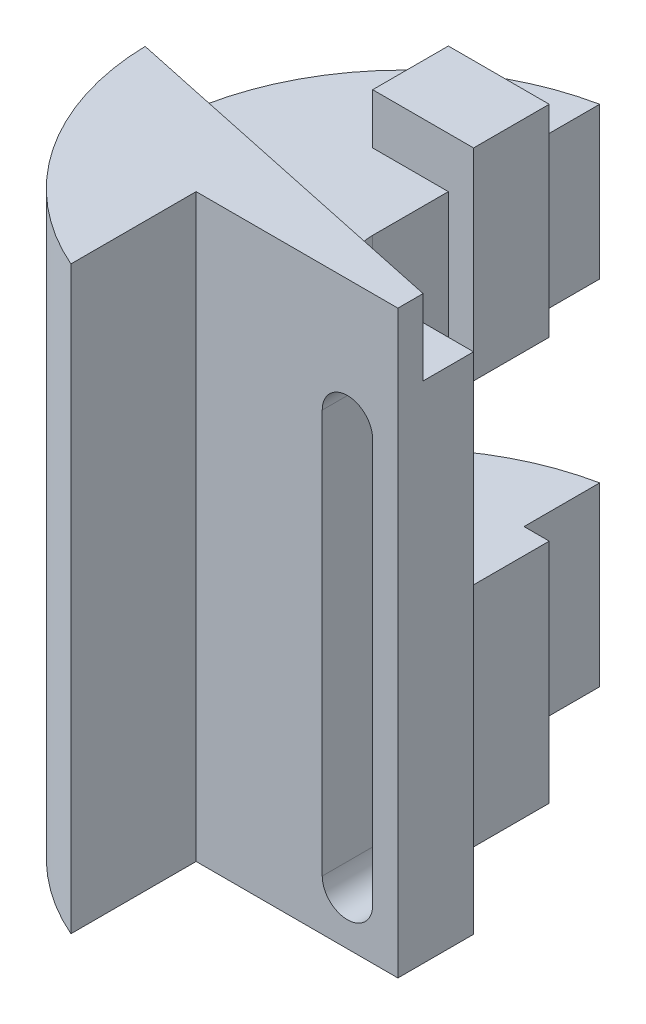
ISO-10303-21;
HEADER;
FILE_DESCRIPTION(('STEP AP214'),'2;1');
FILE_NAME('part.step','',(''),(''),'','','');
FILE_SCHEMA(('AUTOMOTIVE_DESIGN { 1 0 10303 214 1 1 1 1 }'));
ENDSEC;
DATA;
#1=APPLICATION_CONTEXT('core data for automotive mechanical design processes');
#2=APPLICATION_PROTOCOL_DEFINITION('international standard','automotive_design',2000,#1);
#3=PRODUCT_CONTEXT('',#1,'mechanical');
#4=PRODUCT('Part','Part','',(#3));
#5=PRODUCT_RELATED_PRODUCT_CATEGORY('part','',(#4));
#6=PRODUCT_DEFINITION_FORMATION('','',#4);
#7=PRODUCT_DEFINITION_CONTEXT('part definition',#1,'design');
#8=PRODUCT_DEFINITION('design','',#6,#7);
#9=PRODUCT_DEFINITION_SHAPE('','',#8);
#10=(LENGTH_UNIT() NAMED_UNIT(*) SI_UNIT(.MILLI.,.METRE.));
#11=(NAMED_UNIT(*) PLANE_ANGLE_UNIT() SI_UNIT($,.RADIAN.));
#12=(NAMED_UNIT(*) SI_UNIT($,.STERADIAN.) SOLID_ANGLE_UNIT());
#13=UNCERTAINTY_MEASURE_WITH_UNIT(LENGTH_MEASURE(1.E-05),#10,'distance_accuracy_value','');
#14=(GEOMETRIC_REPRESENTATION_CONTEXT(3) GLOBAL_UNCERTAINTY_ASSIGNED_CONTEXT((#13)) GLOBAL_UNIT_ASSIGNED_CONTEXT((#10,
#11,#12)) REPRESENTATION_CONTEXT('',''));
#15=CARTESIAN_POINT('',(0.,0.,0.));
#16=DIRECTION('',(0.,0.,1.));
#17=DIRECTION('',(1.,0.,0.));
#18=AXIS2_PLACEMENT_3D('',#15,#16,#17);
#19=CARTESIAN_POINT('',(-20.,0.,-10.));
#20=DIRECTION('',(0.,-1.,0.));
#21=DIRECTION('',(0.,0.,-1.));
#22=AXIS2_PLACEMENT_3D('',#19,#20,#21);
#23=PLANE('',#22);
#24=DIRECTION('',(0.,0.,-1.));
#25=VECTOR('',#24,1.);
#26=CARTESIAN_POINT('',(-45.0025450609642,0.,-25.));
#27=LINE('',#26,#25);
#28=CARTESIAN_POINT('',(-45.0025450609642,0.,-25.));
#29=VERTEX_POINT('',#28);
#30=CARTESIAN_POINT('',(-45.0025450609642,0.,-40.));
#31=VERTEX_POINT('',#30);
#32=EDGE_CURVE('E255',#29,#31,#27,.T.);
#33=ORIENTED_EDGE('',*,*,#32,.F.);
#34=DIRECTION('',(-1.,0.,0.));
#35=VECTOR('',#34,1.);
#36=CARTESIAN_POINT('',(-30.,0.,-25.));
#37=LINE('',#36,#35);
#38=CARTESIAN_POINT('',(-30.,0.,-25.));
#39=VERTEX_POINT('',#38);
#40=EDGE_CURVE('E244',#39,#29,#37,.T.);
#41=ORIENTED_EDGE('',*,*,#40,.F.);
#42=DIRECTION('',(0.,0.,-1.));
#43=VECTOR('',#42,1.);
#44=CARTESIAN_POINT('',(-30.,0.,-10.0000000000001));
#45=LINE('',#44,#43);
#46=CARTESIAN_POINT('',(-30.,0.,-10.0000000000001));
#47=VERTEX_POINT('',#46);
#48=EDGE_CURVE('E397',#47,#39,#45,.T.);
#49=ORIENTED_EDGE('',*,*,#48,.F.);
#50=CARTESIAN_POINT('',(-20.,0.,-10.));
#51=DIRECTION('',(0.,-1.,0.));
#52=DIRECTION('',(0.,0.,-1.));
#53=AXIS2_PLACEMENT_3D('',#50,#51,#52);
#54=CIRCLE('',#53,10.);
#55=CARTESIAN_POINT('',(-19.9999999999999,0.,0.));
#56=VERTEX_POINT('',#55);
#57=EDGE_CURVE('E393',#56,#47,#54,.T.);
#58=ORIENTED_EDGE('',*,*,#57,.F.);
#59=DIRECTION('',(-1.,0.,0.));
#60=VECTOR('',#59,1.);
#61=CARTESIAN_POINT('',(0.,0.,0.));
#62=LINE('',#61,#60);
#63=CARTESIAN_POINT('',(0.,0.,0.));
#64=VERTEX_POINT('',#63);
#65=EDGE_CURVE('E377',#64,#56,#62,.T.);
#66=ORIENTED_EDGE('',*,*,#65,.F.);
#67=DIRECTION('',(0.,0.,-1.));
#68=VECTOR('',#67,1.);
#69=CARTESIAN_POINT('',(0.,0.,0.));
#70=LINE('',#69,#68);
#71=CARTESIAN_POINT('',(0.,0.,15.));
#72=VERTEX_POINT('',#71);
#73=EDGE_CURVE('E383',#72,#64,#70,.T.);
#74=ORIENTED_EDGE('',*,*,#73,.F.);
#75=DIRECTION('',(1.,0.,0.));
#76=VECTOR('',#75,1.);
#77=CARTESIAN_POINT('',(0.,0.,15.));
#78=LINE('',#77,#76);
#79=CARTESIAN_POINT('',(-40.,0.,15.));
#80=VERTEX_POINT('',#79);
#81=EDGE_CURVE('E404',#80,#72,#78,.T.);
#82=ORIENTED_EDGE('',*,*,#81,.F.);
#83=DIRECTION('',(0.,0.,-1.));
#84=VECTOR('',#83,1.);
#85=CARTESIAN_POINT('',(-40.,0.,15.));
#86=LINE('',#85,#84);
#87=CARTESIAN_POINT('',(-40.,0.,39.815551805222));
#88=VERTEX_POINT('',#87);
#89=EDGE_CURVE('E402',#88,#80,#86,.T.);
#90=ORIENTED_EDGE('',*,*,#89,.F.);
#91=CARTESIAN_POINT('',(-20.,0.,-6.01020514433643));
#92=DIRECTION('',(0.,1.,0.));
#93=DIRECTION('',(0.,0.,1.));
#94=AXIS2_PLACEMENT_3D('',#91,#92,#93);
#95=CIRCLE('',#94,50.);
#96=CARTESIAN_POINT('',(-30.,0.,-55.));
#97=VERTEX_POINT('',#96);
#98=EDGE_CURVE('E400',#97,#88,#95,.T.);
#99=ORIENTED_EDGE('',*,*,#98,.F.);
#100=CARTESIAN_POINT('',(-30.,0.,-40.));
#101=VERTEX_POINT('',#100);
#102=EDGE_CURVE('E396',#101,#97,#45,.T.);
#103=ORIENTED_EDGE('',*,*,#102,.F.);
#104=DIRECTION('',(1.,0.,0.));
#105=VECTOR('',#104,1.);
#106=CARTESIAN_POINT('',(-30.,0.,-40.));
#107=LINE('',#106,#105);
#108=EDGE_CURVE('E252',#31,#101,#107,.T.);
#109=ORIENTED_EDGE('',*,*,#108,.F.);
#110=EDGE_LOOP('',(#33,#41,#49,#58,#66,#74,#82,#90,#99,#103,#109));
#111=FACE_BOUND('',#110,.T.);
#112=ADVANCED_FACE('F41',(#111),#23,.T.);
#113=CARTESIAN_POINT('',(-19.9999999999999,100.,-10.0000000000001));
#114=DIRECTION('',(0.,1.,0.));
#115=DIRECTION('',(0.,0.,1.));
#116=AXIS2_PLACEMENT_3D('',#113,#114,#115);
#117=PLANE('',#116);
#118=DIRECTION('',(0.,0.,1.));
#119=VECTOR('',#118,1.);
#120=CARTESIAN_POINT('',(-45.,100.,-40.));
#121=LINE('',#120,#119);
#122=CARTESIAN_POINT('',(-45.,100.,-40.));
#123=VERTEX_POINT('',#122);
#124=CARTESIAN_POINT('',(-45.,100.,-25.));
#125=VERTEX_POINT('',#124);
#126=EDGE_CURVE('E265',#123,#125,#121,.T.);
#127=ORIENTED_EDGE('',*,*,#126,.F.);
#128=DIRECTION('',(-1.,0.,0.));
#129=VECTOR('',#128,1.);
#130=CARTESIAN_POINT('',(-30.,100.,-40.));
#131=LINE('',#130,#129);
#132=CARTESIAN_POINT('',(-30.,100.,-40.));
#133=VERTEX_POINT('',#132);
#134=EDGE_CURVE('E247',#133,#123,#131,.T.);
#135=ORIENTED_EDGE('',*,*,#134,.F.);
#136=DIRECTION('',(0.,0.,-1.));
#137=VECTOR('',#136,1.);
#138=CARTESIAN_POINT('',(-30.,100.,-55.));
#139=LINE('',#138,#137);
#140=CARTESIAN_POINT('',(-30.,100.,-55.));
#141=VERTEX_POINT('',#140);
#142=EDGE_CURVE('E279',#133,#141,#139,.T.);
#143=ORIENTED_EDGE('',*,*,#142,.T.);
#144=CARTESIAN_POINT('',(-20.,100.,-6.01020514433643));
#145=DIRECTION('',(0.,1.,0.));
#146=DIRECTION('',(0.,0.,1.));
#147=AXIS2_PLACEMENT_3D('',#144,#145,#146);
#148=CIRCLE('',#147,50.);
#149=CARTESIAN_POINT('',(-69.987139251767,100.,-4.87622568047638));
#150=VERTEX_POINT('',#149);
#151=EDGE_CURVE('E283',#141,#150,#148,.T.);
#152=ORIENTED_EDGE('',*,*,#151,.T.);
#153=DIRECTION('',(0.978147600733806,0.,0.207911690817756));
#154=VECTOR('',#153,1.);
#155=CARTESIAN_POINT('',(0.,100.,10.));
#156=LINE('',#155,#154);
#157=CARTESIAN_POINT('',(0.,100.,10.));
#158=VERTEX_POINT('',#157);
#159=EDGE_CURVE('E285',#150,#158,#156,.T.);
#160=ORIENTED_EDGE('',*,*,#159,.T.);
#161=DIRECTION('',(0.,0.,-1.));
#162=VECTOR('',#161,1.);
#163=CARTESIAN_POINT('',(0.,100.,10.));
#164=LINE('',#163,#162);
#165=CARTESIAN_POINT('',(0.,100.,0.));
#166=VERTEX_POINT('',#165);
#167=EDGE_CURVE('E273',#158,#166,#164,.T.);
#168=ORIENTED_EDGE('',*,*,#167,.T.);
#169=DIRECTION('',(-1.,0.,0.));
#170=VECTOR('',#169,1.);
#171=CARTESIAN_POINT('',(0.,100.,0.));
#172=LINE('',#171,#170);
#173=CARTESIAN_POINT('',(-19.9999999999999,100.,0.));
#174=VERTEX_POINT('',#173);
#175=EDGE_CURVE('E275',#166,#174,#172,.T.);
#176=ORIENTED_EDGE('',*,*,#175,.T.);
#177=CARTESIAN_POINT('',(-19.9999999999999,100.,-10.0000000000001));
#178=DIRECTION('',(0.,-1.,0.));
#179=DIRECTION('',(0.,0.,1.));
#180=AXIS2_PLACEMENT_3D('',#177,#178,#179);
#181=CIRCLE('',#180,10.0000000000001);
#182=CARTESIAN_POINT('',(-30.,100.,-10.0000000000001));
#183=VERTEX_POINT('',#182);
#184=EDGE_CURVE('E277',#174,#183,#181,.T.);
#185=ORIENTED_EDGE('',*,*,#184,.T.);
#186=CARTESIAN_POINT('',(-30.,100.,-25.));
#187=VERTEX_POINT('',#186);
#188=EDGE_CURVE('E280',#183,#187,#139,.T.);
#189=ORIENTED_EDGE('',*,*,#188,.T.);
#190=DIRECTION('',(1.,0.,0.));
#191=VECTOR('',#190,1.);
#192=CARTESIAN_POINT('',(-30.,100.,-25.));
#193=LINE('',#192,#191);
#194=EDGE_CURVE('E263',#125,#187,#193,.T.);
#195=ORIENTED_EDGE('',*,*,#194,.F.);
#196=EDGE_LOOP('',(#127,#135,#143,#152,#160,#168,#176,#185,#189,#195));
#197=FACE_BOUND('',#196,.T.);
#198=ADVANCED_FACE('F475',(#197),#117,.T.);
#199=CARTESIAN_POINT('',(-30.,115.,-10.0000000000001));
#200=DIRECTION('',(-1.,0.,0.));
#201=DIRECTION('',(0.,0.,1.));
#202=AXIS2_PLACEMENT_3D('',#199,#200,#201);
#203=PLANE('',#202);
#204=ORIENTED_EDGE('',*,*,#188,.F.);
#205=DIRECTION('',(0.,-1.,0.));
#206=VECTOR('',#205,1.);
#207=CARTESIAN_POINT('',(-30.,115.,-10.0000000000001));
#208=LINE('',#207,#206);
#209=EDGE_CURVE('E421',#183,#47,#208,.T.);
#210=ORIENTED_EDGE('',*,*,#209,.T.);
#211=ORIENTED_EDGE('',*,*,#48,.T.);
#212=DIRECTION('',(0.,-1.,0.));
#213=VECTOR('',#212,1.);
#214=CARTESIAN_POINT('',(-30.,35.,-25.));
#215=LINE('',#214,#213);
#216=CARTESIAN_POINT('',(-30.,35.,-25.));
#217=VERTEX_POINT('',#216);
#218=EDGE_CURVE('E299',#217,#39,#215,.T.);
#219=ORIENTED_EDGE('',*,*,#218,.F.);
#220=DIRECTION('',(0.,0.,-1.));
#221=VECTOR('',#220,1.);
#222=CARTESIAN_POINT('',(-30.,35.,-55.));
#223=LINE('',#222,#221);
#224=CARTESIAN_POINT('',(-30.,35.,-15.));
#225=VERTEX_POINT('',#224);
#226=EDGE_CURVE('E371',#225,#217,#223,.T.);
#227=ORIENTED_EDGE('',*,*,#226,.F.);
#228=DIRECTION('',(0.,-1.,0.));
#229=VECTOR('',#228,1.);
#230=CARTESIAN_POINT('',(-30.,70.,-15.));
#231=LINE('',#230,#229);
#232=CARTESIAN_POINT('',(-30.,70.,-15.));
#233=VERTEX_POINT('',#232);
#234=EDGE_CURVE('E367',#233,#225,#231,.T.);
#235=ORIENTED_EDGE('',*,*,#234,.F.);
#236=DIRECTION('',(0.,0.,1.));
#237=VECTOR('',#236,1.);
#238=CARTESIAN_POINT('',(-30.,70.,-55.));
#239=LINE('',#238,#237);
#240=CARTESIAN_POINT('',(-30.,70.,-25.));
#241=VERTEX_POINT('',#240);
#242=EDGE_CURVE('E363',#241,#233,#239,.T.);
#243=ORIENTED_EDGE('',*,*,#242,.F.);
#244=DIRECTION('',(0.,-1.,0.));
#245=VECTOR('',#244,1.);
#246=CARTESIAN_POINT('',(-30.,70.,-25.));
#247=LINE('',#246,#245);
#248=EDGE_CURVE('E321',#187,#241,#247,.T.);
#249=ORIENTED_EDGE('',*,*,#248,.F.);
#250=EDGE_LOOP('',(#204,#210,#211,#219,#227,#235,#243,#249));
#251=FACE_BOUND('',#250,.T.);
#252=ADVANCED_FACE('F491',(#251),#203,.F.);
#253=ORIENTED_EDGE('',*,*,#142,.F.);
#254=DIRECTION('',(0.,1.,0.));
#255=VECTOR('',#254,1.);
#256=CARTESIAN_POINT('',(-30.,70.,-40.));
#257=LINE('',#256,#255);
#258=CARTESIAN_POINT('',(-30.,70.,-40.));
#259=VERTEX_POINT('',#258);
#260=EDGE_CURVE('E306',#259,#133,#257,.T.);
#261=ORIENTED_EDGE('',*,*,#260,.F.);
#262=CARTESIAN_POINT('',(-30.,70.,-55.));
#263=VERTEX_POINT('',#262);
#264=EDGE_CURVE('E364',#263,#259,#239,.T.);
#265=ORIENTED_EDGE('',*,*,#264,.F.);
#266=DIRECTION('',(0.,-1.,0.));
#267=VECTOR('',#266,1.);
#268=CARTESIAN_POINT('',(-30.,115.,-55.));
#269=LINE('',#268,#267);
#270=EDGE_CURVE('E419',#141,#263,#269,.T.);
#271=ORIENTED_EDGE('',*,*,#270,.F.);
#272=EDGE_LOOP('',(#253,#261,#265,#271));
#273=FACE_BOUND('',#272,.T.);
#274=ADVANCED_FACE('F540',(#273),#203,.F.);
#275=CARTESIAN_POINT('',(0.,115.,0.));
#276=DIRECTION('',(0.,0.,1.));
#277=DIRECTION('',(1.,0.,0.));
#278=AXIS2_PLACEMENT_3D('',#275,#276,#277);
#279=PLANE('',#278);
#280=DIRECTION('',(0.,-1.,0.));
#281=VECTOR('',#280,1.);
#282=CARTESIAN_POINT('',(-4.99999999999998,90.,0.));
#283=LINE('',#282,#281);
#284=CARTESIAN_POINT('',(-4.99999999999998,90.,0.));
#285=VERTEX_POINT('',#284);
#286=CARTESIAN_POINT('',(-5.,9.99999999999999,0.));
#287=VERTEX_POINT('',#286);
#288=EDGE_CURVE('E342',#285,#287,#283,.T.);
#289=ORIENTED_EDGE('',*,*,#288,.F.);
#290=CARTESIAN_POINT('',(-9.99999999999997,90.,0.));
#291=DIRECTION('',(0.,0.,-1.));
#292=DIRECTION('',(1.,0.,0.));
#293=AXIS2_PLACEMENT_3D('',#290,#291,#292);
#294=CIRCLE('',#293,5.);
#295=CARTESIAN_POINT('',(-15.,90.,0.));
#296=VERTEX_POINT('',#295);
#297=EDGE_CURVE('E340',#296,#285,#294,.T.);
#298=ORIENTED_EDGE('',*,*,#297,.F.);
#299=DIRECTION('',(0.,1.,0.));
#300=VECTOR('',#299,1.);
#301=CARTESIAN_POINT('',(-15.,90.,0.));
#302=LINE('',#301,#300);
#303=CARTESIAN_POINT('',(-15.,9.99999999999999,0.));
#304=VERTEX_POINT('',#303);
#305=EDGE_CURVE('E348',#304,#296,#302,.T.);
#306=ORIENTED_EDGE('',*,*,#305,.F.);
#307=CARTESIAN_POINT('',(-10.,9.99999999999999,0.));
#308=DIRECTION('',(0.,0.,-1.));
#309=DIRECTION('',(-1.,0.,0.));
#310=AXIS2_PLACEMENT_3D('',#307,#308,#309);
#311=CIRCLE('',#310,5.);
#312=EDGE_CURVE('E345',#287,#304,#311,.T.);
#313=ORIENTED_EDGE('',*,*,#312,.F.);
#314=EDGE_LOOP('',(#289,#298,#306,#313));
#315=FACE_BOUND('',#314,.T.);
#316=ORIENTED_EDGE('',*,*,#175,.F.);
#317=DIRECTION('',(0.,-1.,0.));
#318=VECTOR('',#317,1.);
#319=CARTESIAN_POINT('',(0.,115.,0.));
#320=LINE('',#319,#318);
#321=EDGE_CURVE('E390',#166,#64,#320,.T.);
#322=ORIENTED_EDGE('',*,*,#321,.T.);
#323=ORIENTED_EDGE('',*,*,#65,.T.);
#324=DIRECTION('',(0.,-1.,0.));
#325=VECTOR('',#324,1.);
#326=CARTESIAN_POINT('',(-19.9999999999999,115.,0.));
#327=LINE('',#326,#325);
#328=EDGE_CURVE('E423',#174,#56,#327,.T.);
#329=ORIENTED_EDGE('',*,*,#328,.F.);
#330=EDGE_LOOP('',(#316,#322,#323,#329));
#331=FACE_BOUND('',#330,.T.);
#332=ADVANCED_FACE('F43',(#315,#331),#279,.F.);
#333=CARTESIAN_POINT('',(-20.,115.,-10.));
#334=DIRECTION('',(0.,-1.,0.));
#335=DIRECTION('',(0.,0.,-1.));
#336=AXIS2_PLACEMENT_3D('',#333,#334,#335);
#337=CYLINDRICAL_SURFACE('',#336,10.);
#338=ORIENTED_EDGE('',*,*,#184,.F.);
#339=ORIENTED_EDGE('',*,*,#328,.T.);
#340=ORIENTED_EDGE('',*,*,#57,.T.);
#341=ORIENTED_EDGE('',*,*,#209,.F.);
#342=EDGE_LOOP('',(#338,#339,#340,#341));
#343=FACE_BOUND('',#342,.T.);
#344=ADVANCED_FACE('F487',(#343),#337,.F.);
#345=DIRECTION('',(0.,1.,0.));
#346=VECTOR('',#345,1.);
#347=CARTESIAN_POINT('',(-30.,35.,-40.));
#348=LINE('',#347,#346);
#349=CARTESIAN_POINT('',(-30.,35.,-40.));
#350=VERTEX_POINT('',#349);
#351=EDGE_CURVE('E304',#101,#350,#348,.T.);
#352=ORIENTED_EDGE('',*,*,#351,.F.);
#353=ORIENTED_EDGE('',*,*,#102,.T.);
#354=CARTESIAN_POINT('',(-30.,35.,-55.));
#355=VERTEX_POINT('',#354);
#356=EDGE_CURVE('E418',#355,#97,#269,.T.);
#357=ORIENTED_EDGE('',*,*,#356,.F.);
#358=EDGE_CURVE('E370',#350,#355,#223,.T.);
#359=ORIENTED_EDGE('',*,*,#358,.F.);
#360=EDGE_LOOP('',(#352,#353,#357,#359));
#361=FACE_BOUND('',#360,.T.);
#362=ADVANCED_FACE('F445',(#361),#203,.F.);
#363=CARTESIAN_POINT('',(-20.,115.,-6.01020514433643));
#364=DIRECTION('',(0.,-1.,0.));
#365=DIRECTION('',(0.,0.,-1.));
#366=AXIS2_PLACEMENT_3D('',#363,#364,#365);
#367=CYLINDRICAL_SURFACE('',#366,50.);
#368=CARTESIAN_POINT('',(-20.,115.,-6.01020514433643));
#369=DIRECTION('',(0.,1.,0.));
#370=DIRECTION('',(0.,0.,1.));
#371=AXIS2_PLACEMENT_3D('',#368,#369,#370);
#372=CIRCLE('',#371,50.);
#373=CARTESIAN_POINT('',(-69.987139251767,115.,-4.87622568047638));
#374=VERTEX_POINT('',#373);
#375=CARTESIAN_POINT('',(-40.,115.,39.815551805222));
#376=VERTEX_POINT('',#375);
#377=EDGE_CURVE('E380',#374,#376,#372,.T.);
#378=ORIENTED_EDGE('',*,*,#377,.F.);
#379=DIRECTION('',(0.,1.,0.));
#380=VECTOR('',#379,1.);
#381=CARTESIAN_POINT('',(-69.987139251767,100.,-4.87622568047638));
#382=LINE('',#381,#380);
#383=EDGE_CURVE('E288',#150,#374,#382,.T.);
#384=ORIENTED_EDGE('',*,*,#383,.F.);
#385=ORIENTED_EDGE('',*,*,#151,.F.);
#386=ORIENTED_EDGE('',*,*,#270,.T.);
#387=CARTESIAN_POINT('',(-20.,70.,-6.01020514433643));
#388=DIRECTION('',(0.,1.,0.));
#389=DIRECTION('',(0.,0.,1.));
#390=AXIS2_PLACEMENT_3D('',#387,#388,#389);
#391=CIRCLE('',#390,50.);
#392=CARTESIAN_POINT('',(-69.1851968426791,70.,-15.));
#393=VERTEX_POINT('',#392);
#394=EDGE_CURVE('E425',#263,#393,#391,.T.);
#395=ORIENTED_EDGE('',*,*,#394,.T.);
#396=DIRECTION('',(0.,-1.,0.));
#397=VECTOR('',#396,1.);
#398=CARTESIAN_POINT('',(-69.1851968426791,115.,-15.));
#399=LINE('',#398,#397);
#400=CARTESIAN_POINT('',(-69.1851968426791,35.,-15.));
#401=VERTEX_POINT('',#400);
#402=EDGE_CURVE('E49',#393,#401,#399,.T.);
#403=ORIENTED_EDGE('',*,*,#402,.T.);
#404=CARTESIAN_POINT('',(-20.,35.,-6.01020514433643));
#405=DIRECTION('',(0.,-1.,0.));
#406=DIRECTION('',(0.,0.,-1.));
#407=AXIS2_PLACEMENT_3D('',#404,#405,#406);
#408=CIRCLE('',#407,50.);
#409=EDGE_CURVE('E11',#401,#355,#408,.T.);
#410=ORIENTED_EDGE('',*,*,#409,.T.);
#411=ORIENTED_EDGE('',*,*,#356,.T.);
#412=ORIENTED_EDGE('',*,*,#98,.T.);
#413=DIRECTION('',(0.,-1.,0.));
#414=VECTOR('',#413,1.);
#415=CARTESIAN_POINT('',(-40.,115.,39.815551805222));
#416=LINE('',#415,#414);
#417=EDGE_CURVE('E415',#376,#88,#416,.T.);
#418=ORIENTED_EDGE('',*,*,#417,.F.);
#419=EDGE_LOOP('',(#378,#384,#385,#386,#395,#403,#410,#411,#412,#418));
#420=FACE_BOUND('',#419,.T.);
#421=ADVANCED_FACE('F431',(#420),#367,.T.);
#422=CARTESIAN_POINT('',(-40.,115.,15.));
#423=DIRECTION('',(-1.,0.,0.));
#424=DIRECTION('',(0.,0.,1.));
#425=AXIS2_PLACEMENT_3D('',#422,#423,#424);
#426=PLANE('',#425);
#427=ORIENTED_EDGE('',*,*,#89,.T.);
#428=DIRECTION('',(0.,-1.,0.));
#429=VECTOR('',#428,1.);
#430=CARTESIAN_POINT('',(-40.,115.,15.));
#431=LINE('',#430,#429);
#432=CARTESIAN_POINT('',(-40.,115.,15.));
#433=VERTEX_POINT('',#432);
#434=EDGE_CURVE('E412',#433,#80,#431,.T.);
#435=ORIENTED_EDGE('',*,*,#434,.F.);
#436=DIRECTION('',(0.,0.,-1.));
#437=VECTOR('',#436,1.);
#438=CARTESIAN_POINT('',(-40.,115.,15.));
#439=LINE('',#438,#437);
#440=EDGE_CURVE('E382',#376,#433,#439,.T.);
#441=ORIENTED_EDGE('',*,*,#440,.F.);
#442=ORIENTED_EDGE('',*,*,#417,.T.);
#443=EDGE_LOOP('',(#427,#435,#441,#442));
#444=FACE_BOUND('',#443,.T.);
#445=ADVANCED_FACE('F456',(#444),#426,.F.);
#446=CARTESIAN_POINT('',(0.,115.,15.));
#447=DIRECTION('',(0.,0.,-1.));
#448=DIRECTION('',(-1.,0.,0.));
#449=AXIS2_PLACEMENT_3D('',#446,#447,#448);
#450=PLANE('',#449);
#451=DIRECTION('',(0.,-1.,0.));
#452=VECTOR('',#451,1.);
#453=CARTESIAN_POINT('',(-15.,90.,15.));
#454=LINE('',#453,#452);
#455=CARTESIAN_POINT('',(-15.,90.,15.));
#456=VERTEX_POINT('',#455);
#457=CARTESIAN_POINT('',(-15.,9.99999999999999,15.));
#458=VERTEX_POINT('',#457);
#459=EDGE_CURVE('E334',#456,#458,#454,.T.);
#460=ORIENTED_EDGE('',*,*,#459,.F.);
#461=CARTESIAN_POINT('',(-9.99999999999997,90.,15.));
#462=DIRECTION('',(0.,0.,-1.));
#463=DIRECTION('',(-1.,0.,0.));
#464=AXIS2_PLACEMENT_3D('',#461,#462,#463);
#465=CIRCLE('',#464,5.);
#466=CARTESIAN_POINT('',(-4.99999999999997,90.,15.));
#467=VERTEX_POINT('',#466);
#468=EDGE_CURVE('E337',#467,#456,#465,.F.);
#469=ORIENTED_EDGE('',*,*,#468,.F.);
#470=DIRECTION('',(0.,1.,0.));
#471=VECTOR('',#470,1.);
#472=CARTESIAN_POINT('',(-4.99999999999997,90.,15.));
#473=LINE('',#472,#471);
#474=CARTESIAN_POINT('',(-5.,9.99999999999999,15.));
#475=VERTEX_POINT('',#474);
#476=EDGE_CURVE('E354',#475,#467,#473,.T.);
#477=ORIENTED_EDGE('',*,*,#476,.F.);
#478=CARTESIAN_POINT('',(-10.,9.99999999999999,15.));
#479=DIRECTION('',(0.,0.,-1.));
#480=DIRECTION('',(-1.,0.,0.));
#481=AXIS2_PLACEMENT_3D('',#478,#479,#480);
#482=CIRCLE('',#481,5.);
#483=EDGE_CURVE('E311',#458,#475,#482,.F.);
#484=ORIENTED_EDGE('',*,*,#483,.F.);
#485=EDGE_LOOP('',(#460,#469,#477,#484));
#486=FACE_BOUND('',#485,.T.);
#487=ORIENTED_EDGE('',*,*,#81,.T.);
#488=DIRECTION('',(0.,-1.,0.));
#489=VECTOR('',#488,1.);
#490=CARTESIAN_POINT('',(0.,115.,15.));
#491=LINE('',#490,#489);
#492=CARTESIAN_POINT('',(0.,115.,15.));
#493=VERTEX_POINT('',#492);
#494=EDGE_CURVE('E409',#493,#72,#491,.T.);
#495=ORIENTED_EDGE('',*,*,#494,.F.);
#496=DIRECTION('',(1.,0.,0.));
#497=VECTOR('',#496,1.);
#498=CARTESIAN_POINT('',(0.,115.,15.));
#499=LINE('',#498,#497);
#500=EDGE_CURVE('E385',#433,#493,#499,.T.);
#501=ORIENTED_EDGE('',*,*,#500,.F.);
#502=ORIENTED_EDGE('',*,*,#434,.T.);
#503=EDGE_LOOP('',(#487,#495,#501,#502));
#504=FACE_BOUND('',#503,.T.);
#505=ADVANCED_FACE('F460',(#486,#504),#450,.F.);
#506=CARTESIAN_POINT('',(0.,115.,0.));
#507=DIRECTION('',(-1.,0.,0.));
#508=DIRECTION('',(0.,0.,1.));
#509=AXIS2_PLACEMENT_3D('',#506,#507,#508);
#510=PLANE('',#509);
#511=ORIENTED_EDGE('',*,*,#167,.F.);
#512=DIRECTION('',(0.,1.,0.));
#513=VECTOR('',#512,1.);
#514=CARTESIAN_POINT('',(0.,100.,10.));
#515=LINE('',#514,#513);
#516=CARTESIAN_POINT('',(0.,115.,10.));
#517=VERTEX_POINT('',#516);
#518=EDGE_CURVE('E290',#158,#517,#515,.T.);
#519=ORIENTED_EDGE('',*,*,#518,.T.);
#520=DIRECTION('',(0.,0.,-1.));
#521=VECTOR('',#520,1.);
#522=CARTESIAN_POINT('',(0.,115.,0.));
#523=LINE('',#522,#521);
#524=EDGE_CURVE('E387',#493,#517,#523,.T.);
#525=ORIENTED_EDGE('',*,*,#524,.F.);
#526=ORIENTED_EDGE('',*,*,#494,.T.);
#527=ORIENTED_EDGE('',*,*,#73,.T.);
#528=ORIENTED_EDGE('',*,*,#321,.F.);
#529=EDGE_LOOP('',(#511,#519,#525,#526,#527,#528));
#530=FACE_BOUND('',#529,.T.);
#531=ADVANCED_FACE('F479',(#530),#510,.F.);
#532=CARTESIAN_POINT('',(-20.,115.,-10.));
#533=DIRECTION('',(0.,-1.,0.));
#534=DIRECTION('',(0.,0.,-1.));
#535=AXIS2_PLACEMENT_3D('',#532,#533,#534);
#536=PLANE('',#535);
#537=ORIENTED_EDGE('',*,*,#524,.T.);
#538=DIRECTION('',(0.978147600733806,0.,0.207911690817756));
#539=VECTOR('',#538,1.);
#540=CARTESIAN_POINT('',(0.,115.,10.));
#541=LINE('',#540,#539);
#542=EDGE_CURVE('E272',#374,#517,#541,.T.);
#543=ORIENTED_EDGE('',*,*,#542,.F.);
#544=ORIENTED_EDGE('',*,*,#377,.T.);
#545=ORIENTED_EDGE('',*,*,#440,.T.);
#546=ORIENTED_EDGE('',*,*,#500,.T.);
#547=EDGE_LOOP('',(#537,#543,#544,#545,#546));
#548=FACE_BOUND('',#547,.T.);
#549=ADVANCED_FACE('F464',(#548),#536,.F.);
#550=CARTESIAN_POINT('',(-70.,35.,-55.));
#551=DIRECTION('',(0.,-1.,0.));
#552=DIRECTION('',(0.,0.,-1.));
#553=AXIS2_PLACEMENT_3D('',#550,#551,#552);
#554=PLANE('',#553);
#555=DIRECTION('',(1.,0.,0.));
#556=VECTOR('',#555,1.);
#557=CARTESIAN_POINT('',(-70.,35.,-15.));
#558=LINE('',#557,#556);
#559=EDGE_CURVE('E375',#401,#225,#558,.T.);
#560=ORIENTED_EDGE('',*,*,#559,.T.);
#561=ORIENTED_EDGE('',*,*,#226,.T.);
#562=DIRECTION('',(-1.,0.,0.));
#563=VECTOR('',#562,1.);
#564=CARTESIAN_POINT('',(-25.,35.,-25.));
#565=LINE('',#564,#563);
#566=CARTESIAN_POINT('',(-25.,35.,-25.));
#567=VERTEX_POINT('',#566);
#568=EDGE_CURVE('E237',#567,#217,#565,.T.);
#569=ORIENTED_EDGE('',*,*,#568,.F.);
#570=DIRECTION('',(0.,0.,1.));
#571=VECTOR('',#570,1.);
#572=CARTESIAN_POINT('',(-25.,35.,-40.));
#573=LINE('',#572,#571);
#574=CARTESIAN_POINT('',(-25.,35.,-40.));
#575=VERTEX_POINT('',#574);
#576=EDGE_CURVE('E298',#575,#567,#573,.T.);
#577=ORIENTED_EDGE('',*,*,#576,.F.);
#578=DIRECTION('',(-1.,0.,0.));
#579=VECTOR('',#578,1.);
#580=CARTESIAN_POINT('',(-25.,35.,-40.));
#581=LINE('',#580,#579);
#582=EDGE_CURVE('E64',#575,#350,#581,.T.);
#583=ORIENTED_EDGE('',*,*,#582,.T.);
#584=ORIENTED_EDGE('',*,*,#358,.T.);
#585=ORIENTED_EDGE('',*,*,#409,.F.);
#586=EDGE_LOOP('',(#560,#561,#569,#577,#583,#584,#585));
#587=FACE_BOUND('',#586,.T.);
#588=ADVANCED_FACE('F440',(#587),#554,.F.);
#589=CARTESIAN_POINT('',(-70.,70.,-15.));
#590=DIRECTION('',(0.,0.,1.));
#591=DIRECTION('',(0.,-1.,0.));
#592=AXIS2_PLACEMENT_3D('',#589,#590,#591);
#593=PLANE('',#592);
#594=DIRECTION('',(1.,0.,0.));
#595=VECTOR('',#594,1.);
#596=CARTESIAN_POINT('',(-70.,70.,-15.));
#597=LINE('',#596,#595);
#598=EDGE_CURVE('E374',#393,#233,#597,.T.);
#599=ORIENTED_EDGE('',*,*,#598,.T.);
#600=ORIENTED_EDGE('',*,*,#234,.T.);
#601=ORIENTED_EDGE('',*,*,#559,.F.);
#602=ORIENTED_EDGE('',*,*,#402,.F.);
#603=EDGE_LOOP('',(#599,#600,#601,#602));
#604=FACE_BOUND('',#603,.T.);
#605=ADVANCED_FACE('F437',(#604),#593,.F.);
#606=CARTESIAN_POINT('',(-70.,70.,-55.));
#607=DIRECTION('',(0.,1.,0.));
#608=DIRECTION('',(0.,0.,1.));
#609=AXIS2_PLACEMENT_3D('',#606,#607,#608);
#610=PLANE('',#609);
#611=ORIENTED_EDGE('',*,*,#264,.T.);
#612=DIRECTION('',(-1.,0.,0.));
#613=VECTOR('',#612,1.);
#614=CARTESIAN_POINT('',(-25.,70.,-40.));
#615=LINE('',#614,#613);
#616=CARTESIAN_POINT('',(-25.,70.,-40.));
#617=VERTEX_POINT('',#616);
#618=EDGE_CURVE('E318',#617,#259,#615,.T.);
#619=ORIENTED_EDGE('',*,*,#618,.F.);
#620=DIRECTION('',(0.,0.,-1.));
#621=VECTOR('',#620,1.);
#622=CARTESIAN_POINT('',(-25.,70.,-40.));
#623=LINE('',#622,#621);
#624=CARTESIAN_POINT('',(-25.,70.,-25.));
#625=VERTEX_POINT('',#624);
#626=EDGE_CURVE('E320',#625,#617,#623,.T.);
#627=ORIENTED_EDGE('',*,*,#626,.F.);
#628=DIRECTION('',(-1.,0.,0.));
#629=VECTOR('',#628,1.);
#630=CARTESIAN_POINT('',(-25.,70.,-25.));
#631=LINE('',#630,#629);
#632=EDGE_CURVE('E315',#625,#241,#631,.T.);
#633=ORIENTED_EDGE('',*,*,#632,.T.);
#634=ORIENTED_EDGE('',*,*,#242,.T.);
#635=ORIENTED_EDGE('',*,*,#598,.F.);
#636=ORIENTED_EDGE('',*,*,#394,.F.);
#637=EDGE_LOOP('',(#611,#619,#627,#633,#634,#635,#636));
#638=FACE_BOUND('',#637,.T.);
#639=ADVANCED_FACE('F501',(#638),#610,.F.);
#640=CARTESIAN_POINT('',(-9.99999999999997,90.,39.816551805222));
#641=DIRECTION('',(0.,0.,-1.));
#642=DIRECTION('',(-1.,0.,0.));
#643=AXIS2_PLACEMENT_3D('',#640,#641,#642);
#644=CYLINDRICAL_SURFACE('',#643,5.);
#645=ORIENTED_EDGE('',*,*,#468,.T.);
#646=DIRECTION('',(0.,0.,-1.));
#647=VECTOR('',#646,1.);
#648=CARTESIAN_POINT('',(-15.,90.,39.816551805222));
#649=LINE('',#648,#647);
#650=EDGE_CURVE('E352',#456,#296,#649,.T.);
#651=ORIENTED_EDGE('',*,*,#650,.T.);
#652=ORIENTED_EDGE('',*,*,#297,.T.);
#653=DIRECTION('',(0.,0.,-1.));
#654=VECTOR('',#653,1.);
#655=CARTESIAN_POINT('',(-4.99999999999997,90.,39.816551805222));
#656=LINE('',#655,#654);
#657=EDGE_CURVE('E351',#467,#285,#656,.T.);
#658=ORIENTED_EDGE('',*,*,#657,.F.);
#659=EDGE_LOOP('',(#645,#651,#652,#658));
#660=FACE_BOUND('',#659,.T.);
#661=ADVANCED_FACE('F561',(#660),#644,.F.);
#662=CARTESIAN_POINT('',(-15.,90.,39.816551805222));
#663=DIRECTION('',(-1.,0.,0.));
#664=DIRECTION('',(0.,-1.,0.));
#665=AXIS2_PLACEMENT_3D('',#662,#663,#664);
#666=PLANE('',#665);
#667=ORIENTED_EDGE('',*,*,#459,.T.);
#668=DIRECTION('',(0.,0.,-1.));
#669=VECTOR('',#668,1.);
#670=CARTESIAN_POINT('',(-15.,9.99999999999999,39.816551805222));
#671=LINE('',#670,#669);
#672=EDGE_CURVE('E355',#458,#304,#671,.T.);
#673=ORIENTED_EDGE('',*,*,#672,.T.);
#674=ORIENTED_EDGE('',*,*,#305,.T.);
#675=ORIENTED_EDGE('',*,*,#650,.F.);
#676=EDGE_LOOP('',(#667,#673,#674,#675));
#677=FACE_BOUND('',#676,.T.);
#678=ADVANCED_FACE('F564',(#677),#666,.F.);
#679=CARTESIAN_POINT('',(-9.99999999999999,9.99999999999999,39.816551805222));
#680=DIRECTION('',(0.,0.,-1.));
#681=DIRECTION('',(-1.,0.,0.));
#682=AXIS2_PLACEMENT_3D('',#679,#680,#681);
#683=CYLINDRICAL_SURFACE('',#682,5.);
#684=ORIENTED_EDGE('',*,*,#483,.T.);
#685=DIRECTION('',(0.,0.,-1.));
#686=VECTOR('',#685,1.);
#687=CARTESIAN_POINT('',(-5.,9.99999999999999,39.816551805222));
#688=LINE('',#687,#686);
#689=EDGE_CURVE('E357',#475,#287,#688,.T.);
#690=ORIENTED_EDGE('',*,*,#689,.T.);
#691=ORIENTED_EDGE('',*,*,#312,.T.);
#692=ORIENTED_EDGE('',*,*,#672,.F.);
#693=EDGE_LOOP('',(#684,#690,#691,#692));
#694=FACE_BOUND('',#693,.T.);
#695=ADVANCED_FACE('F567',(#694),#683,.F.);
#696=CARTESIAN_POINT('',(-4.99999999999997,90.,39.816551805222));
#697=DIRECTION('',(1.,0.,0.));
#698=DIRECTION('',(0.,1.,0.));
#699=AXIS2_PLACEMENT_3D('',#696,#697,#698);
#700=PLANE('',#699);
#701=ORIENTED_EDGE('',*,*,#476,.T.);
#702=ORIENTED_EDGE('',*,*,#657,.T.);
#703=ORIENTED_EDGE('',*,*,#288,.T.);
#704=ORIENTED_EDGE('',*,*,#689,.F.);
#705=EDGE_LOOP('',(#701,#702,#703,#704));
#706=FACE_BOUND('',#705,.T.);
#707=ADVANCED_FACE('F557',(#706),#700,.F.);
#708=CARTESIAN_POINT('',(-25.,70.,-40.));
#709=DIRECTION('',(0.,0.,1.));
#710=DIRECTION('',(1.,0.,0.));
#711=AXIS2_PLACEMENT_3D('',#708,#709,#710);
#712=PLANE('',#711);
#713=ORIENTED_EDGE('',*,*,#260,.T.);
#714=ORIENTED_EDGE('',*,*,#134,.T.);
#715=DIRECTION('',(0.,-1.,0.));
#716=VECTOR('',#715,1.);
#717=CARTESIAN_POINT('',(-45.,110.,-40.));
#718=LINE('',#717,#716);
#719=CARTESIAN_POINT('',(-45.,110.,-40.));
#720=VERTEX_POINT('',#719);
#721=EDGE_CURVE('E269',#720,#123,#718,.T.);
#722=ORIENTED_EDGE('',*,*,#721,.F.);
#723=DIRECTION('',(-1.,0.,0.));
#724=VECTOR('',#723,1.);
#725=CARTESIAN_POINT('',(-25.,110.,-40.));
#726=LINE('',#725,#724);
#727=CARTESIAN_POINT('',(-25.,110.,-40.));
#728=VERTEX_POINT('',#727);
#729=EDGE_CURVE('E293',#728,#720,#726,.T.);
#730=ORIENTED_EDGE('',*,*,#729,.F.);
#731=DIRECTION('',(0.,1.,0.));
#732=VECTOR('',#731,1.);
#733=CARTESIAN_POINT('',(-25.,70.,-40.));
#734=LINE('',#733,#732);
#735=EDGE_CURVE('E323',#617,#728,#734,.T.);
#736=ORIENTED_EDGE('',*,*,#735,.F.);
#737=ORIENTED_EDGE('',*,*,#618,.T.);
#738=EDGE_LOOP('',(#713,#714,#722,#730,#736,#737));
#739=FACE_BOUND('',#738,.T.);
#740=ADVANCED_FACE('F574',(#739),#712,.F.);
#741=CARTESIAN_POINT('',(-25.,110.,-40.));
#742=DIRECTION('',(0.,-1.,0.));
#743=DIRECTION('',(0.,0.,-1.));
#744=AXIS2_PLACEMENT_3D('',#741,#742,#743);
#745=PLANE('',#744);
#746=ORIENTED_EDGE('',*,*,#729,.T.);
#747=DIRECTION('',(0.,0.,1.));
#748=VECTOR('',#747,1.);
#749=CARTESIAN_POINT('',(-45.,110.,-40.));
#750=LINE('',#749,#748);
#751=CARTESIAN_POINT('',(-45.,110.,-25.));
#752=VERTEX_POINT('',#751);
#753=EDGE_CURVE('E260',#720,#752,#750,.T.);
#754=ORIENTED_EDGE('',*,*,#753,.T.);
#755=DIRECTION('',(-1.,0.,0.));
#756=VECTOR('',#755,1.);
#757=CARTESIAN_POINT('',(-25.,110.,-25.));
#758=LINE('',#757,#756);
#759=CARTESIAN_POINT('',(-25.,110.,-25.));
#760=VERTEX_POINT('',#759);
#761=EDGE_CURVE('E313',#760,#752,#758,.T.);
#762=ORIENTED_EDGE('',*,*,#761,.F.);
#763=DIRECTION('',(0.,0.,1.));
#764=VECTOR('',#763,1.);
#765=CARTESIAN_POINT('',(-25.,110.,-40.));
#766=LINE('',#765,#764);
#767=EDGE_CURVE('E329',#728,#760,#766,.T.);
#768=ORIENTED_EDGE('',*,*,#767,.F.);
#769=EDGE_LOOP('',(#746,#754,#762,#768));
#770=FACE_BOUND('',#769,.T.);
#771=ADVANCED_FACE('F651',(#770),#745,.F.);
#772=CARTESIAN_POINT('',(-25.,70.,-25.));
#773=DIRECTION('',(0.,0.,-1.));
#774=DIRECTION('',(0.,1.,0.));
#775=AXIS2_PLACEMENT_3D('',#772,#773,#774);
#776=PLANE('',#775);
#777=ORIENTED_EDGE('',*,*,#761,.T.);
#778=DIRECTION('',(0.,-1.,0.));
#779=VECTOR('',#778,1.);
#780=CARTESIAN_POINT('',(-45.,110.,-25.));
#781=LINE('',#780,#779);
#782=EDGE_CURVE('E56',#752,#125,#781,.T.);
#783=ORIENTED_EDGE('',*,*,#782,.T.);
#784=ORIENTED_EDGE('',*,*,#194,.T.);
#785=ORIENTED_EDGE('',*,*,#248,.T.);
#786=ORIENTED_EDGE('',*,*,#632,.F.);
#787=DIRECTION('',(0.,-1.,0.));
#788=VECTOR('',#787,1.);
#789=CARTESIAN_POINT('',(-25.,70.,-25.));
#790=LINE('',#789,#788);
#791=EDGE_CURVE('E327',#760,#625,#790,.T.);
#792=ORIENTED_EDGE('',*,*,#791,.F.);
#793=EDGE_LOOP('',(#777,#783,#784,#785,#786,#792));
#794=FACE_BOUND('',#793,.T.);
#795=ADVANCED_FACE('F496',(#794),#776,.F.);
#796=CARTESIAN_POINT('',(-25.,0.,0.));
#797=DIRECTION('',(1.,0.,0.));
#798=DIRECTION('',(0.,0.,-1.));
#799=AXIS2_PLACEMENT_3D('',#796,#797,#798);
#800=PLANE('',#799);
#801=ORIENTED_EDGE('',*,*,#735,.T.);
#802=ORIENTED_EDGE('',*,*,#767,.T.);
#803=ORIENTED_EDGE('',*,*,#791,.T.);
#804=ORIENTED_EDGE('',*,*,#626,.T.);
#805=EDGE_LOOP('',(#801,#802,#803,#804));
#806=FACE_BOUND('',#805,.T.);
#807=ADVANCED_FACE('F509',(#806),#800,.T.);
#808=CARTESIAN_POINT('',(-25.,35.,-40.));
#809=DIRECTION('',(0.,0.,1.));
#810=DIRECTION('',(0.,-1.,0.));
#811=AXIS2_PLACEMENT_3D('',#808,#809,#810);
#812=PLANE('',#811);
#813=DIRECTION('',(-1.,0.,0.));
#814=VECTOR('',#813,1.);
#815=CARTESIAN_POINT('',(-25.,-10.,-40.));
#816=LINE('',#815,#814);
#817=CARTESIAN_POINT('',(-25.,-10.,-40.));
#818=VERTEX_POINT('',#817);
#819=CARTESIAN_POINT('',(-45.0025450609642,-10.,-40.));
#820=VERTEX_POINT('',#819);
#821=EDGE_CURVE('E238',#818,#820,#816,.T.);
#822=ORIENTED_EDGE('',*,*,#821,.T.);
#823=DIRECTION('',(0.,1.,0.));
#824=VECTOR('',#823,1.);
#825=CARTESIAN_POINT('',(-45.0025450609642,-10.,-40.));
#826=LINE('',#825,#824);
#827=EDGE_CURVE('E248',#820,#31,#826,.T.);
#828=ORIENTED_EDGE('',*,*,#827,.T.);
#829=ORIENTED_EDGE('',*,*,#108,.T.);
#830=ORIENTED_EDGE('',*,*,#351,.T.);
#831=ORIENTED_EDGE('',*,*,#582,.F.);
#832=DIRECTION('',(0.,1.,0.));
#833=VECTOR('',#832,1.);
#834=CARTESIAN_POINT('',(-25.,35.,-40.));
#835=LINE('',#834,#833);
#836=EDGE_CURVE('E295',#818,#575,#835,.T.);
#837=ORIENTED_EDGE('',*,*,#836,.F.);
#838=EDGE_LOOP('',(#822,#828,#829,#830,#831,#837));
#839=FACE_BOUND('',#838,.T.);
#840=ADVANCED_FACE('F507',(#839),#812,.F.);
#841=CARTESIAN_POINT('',(-25.,35.,-25.));
#842=DIRECTION('',(0.,0.,-1.));
#843=DIRECTION('',(0.,1.,0.));
#844=AXIS2_PLACEMENT_3D('',#841,#842,#843);
#845=PLANE('',#844);
#846=ORIENTED_EDGE('',*,*,#218,.T.);
#847=ORIENTED_EDGE('',*,*,#40,.T.);
#848=DIRECTION('',(0.,1.,0.));
#849=VECTOR('',#848,1.);
#850=CARTESIAN_POINT('',(-45.0025450609642,-10.,-25.));
#851=LINE('',#850,#849);
#852=CARTESIAN_POINT('',(-45.0025450609642,-10.,-25.));
#853=VERTEX_POINT('',#852);
#854=EDGE_CURVE('E241',#853,#29,#851,.T.);
#855=ORIENTED_EDGE('',*,*,#854,.F.);
#856=DIRECTION('',(-1.,0.,0.));
#857=VECTOR('',#856,1.);
#858=CARTESIAN_POINT('',(-25.,-10.,-25.));
#859=LINE('',#858,#857);
#860=CARTESIAN_POINT('',(-25.,-10.,-25.));
#861=VERTEX_POINT('',#860);
#862=EDGE_CURVE('E227',#861,#853,#859,.T.);
#863=ORIENTED_EDGE('',*,*,#862,.F.);
#864=DIRECTION('',(0.,-1.,0.));
#865=VECTOR('',#864,1.);
#866=CARTESIAN_POINT('',(-25.,35.,-25.));
#867=LINE('',#866,#865);
#868=EDGE_CURVE('E301',#567,#861,#867,.T.);
#869=ORIENTED_EDGE('',*,*,#868,.F.);
#870=ORIENTED_EDGE('',*,*,#568,.T.);
#871=EDGE_LOOP('',(#846,#847,#855,#863,#869,#870));
#872=FACE_BOUND('',#871,.T.);
#873=ADVANCED_FACE('F243',(#872),#845,.F.);
#874=CARTESIAN_POINT('',(-25.,-10.,-40.));
#875=DIRECTION('',(0.,1.,0.));
#876=DIRECTION('',(0.,0.,1.));
#877=AXIS2_PLACEMENT_3D('',#874,#875,#876);
#878=PLANE('',#877);
#879=ORIENTED_EDGE('',*,*,#862,.T.);
#880=DIRECTION('',(0.,0.,-1.));
#881=VECTOR('',#880,1.);
#882=CARTESIAN_POINT('',(-45.0025450609642,-10.,-25.));
#883=LINE('',#882,#881);
#884=EDGE_CURVE('E232',#853,#820,#883,.T.);
#885=ORIENTED_EDGE('',*,*,#884,.T.);
#886=ORIENTED_EDGE('',*,*,#821,.F.);
#887=DIRECTION('',(0.,0.,-1.));
#888=VECTOR('',#887,1.);
#889=CARTESIAN_POINT('',(-25.,-10.,-40.));
#890=LINE('',#889,#888);
#891=EDGE_CURVE('E234',#861,#818,#890,.T.);
#892=ORIENTED_EDGE('',*,*,#891,.F.);
#893=EDGE_LOOP('',(#879,#885,#886,#892));
#894=FACE_BOUND('',#893,.T.);
#895=ADVANCED_FACE('F229',(#894),#878,.F.);
#896=CARTESIAN_POINT('',(-25.,0.,0.));
#897=DIRECTION('',(-1.,0.,0.));
#898=DIRECTION('',(0.,0.,1.));
#899=AXIS2_PLACEMENT_3D('',#896,#897,#898);
#900=PLANE('',#899);
#901=ORIENTED_EDGE('',*,*,#836,.T.);
#902=ORIENTED_EDGE('',*,*,#576,.T.);
#903=ORIENTED_EDGE('',*,*,#868,.T.);
#904=ORIENTED_EDGE('',*,*,#891,.T.);
#905=EDGE_LOOP('',(#901,#902,#903,#904));
#906=FACE_BOUND('',#905,.T.);
#907=ADVANCED_FACE('F505',(#906),#900,.F.);
#908=CARTESIAN_POINT('',(0.,100.,10.));
#909=DIRECTION('',(-0.207911690817756,0.,0.978147600733806));
#910=DIRECTION('',(0.978147600733806,0.,0.207911690817756));
#911=AXIS2_PLACEMENT_3D('',#908,#909,#910);
#912=PLANE('',#911);
#913=ORIENTED_EDGE('',*,*,#542,.T.);
#914=ORIENTED_EDGE('',*,*,#518,.F.);
#915=ORIENTED_EDGE('',*,*,#159,.F.);
#916=ORIENTED_EDGE('',*,*,#383,.T.);
#917=EDGE_LOOP('',(#913,#914,#915,#916));
#918=FACE_BOUND('',#917,.T.);
#919=ADVANCED_FACE('F471',(#918),#912,.F.);
#920=CARTESIAN_POINT('',(-45.,110.,-40.));
#921=DIRECTION('',(1.,0.,0.));
#922=DIRECTION('',(0.,0.,-1.));
#923=AXIS2_PLACEMENT_3D('',#920,#921,#922);
#924=PLANE('',#923);
#925=ORIENTED_EDGE('',*,*,#126,.T.);
#926=ORIENTED_EDGE('',*,*,#782,.F.);
#927=ORIENTED_EDGE('',*,*,#753,.F.);
#928=ORIENTED_EDGE('',*,*,#721,.T.);
#929=EDGE_LOOP('',(#925,#926,#927,#928));
#930=FACE_BOUND('',#929,.T.);
#931=ADVANCED_FACE('F636',(#930),#924,.F.);
#932=CARTESIAN_POINT('',(-45.0025450609642,-10.,-25.));
#933=DIRECTION('',(1.,0.,0.));
#934=DIRECTION('',(0.,0.,-1.));
#935=AXIS2_PLACEMENT_3D('',#932,#933,#934);
#936=PLANE('',#935);
#937=ORIENTED_EDGE('',*,*,#32,.T.);
#938=ORIENTED_EDGE('',*,*,#827,.F.);
#939=ORIENTED_EDGE('',*,*,#884,.F.);
#940=ORIENTED_EDGE('',*,*,#854,.T.);
#941=EDGE_LOOP('',(#937,#938,#939,#940));
#942=FACE_BOUND('',#941,.T.);
#943=ADVANCED_FACE('F250',(#942),#936,.F.);
#944=CLOSED_SHELL('',(#112,#198,#252,#274,#332,#344,#362,#421,#445,#505,#531,#549,#588,#605,
#639,#661,#678,#695,#707,#740,#771,#795,#807,#840,#873,#895,#907,#919,#931,#943));
#945=MANIFOLD_SOLID_BREP('B2',#944);
#946=ADVANCED_BREP_SHAPE_REPRESENTATION('',(#18,#945),#14);
#947=SHAPE_DEFINITION_REPRESENTATION(#9,#946);
ENDSEC;
END-ISO-10303-21;
